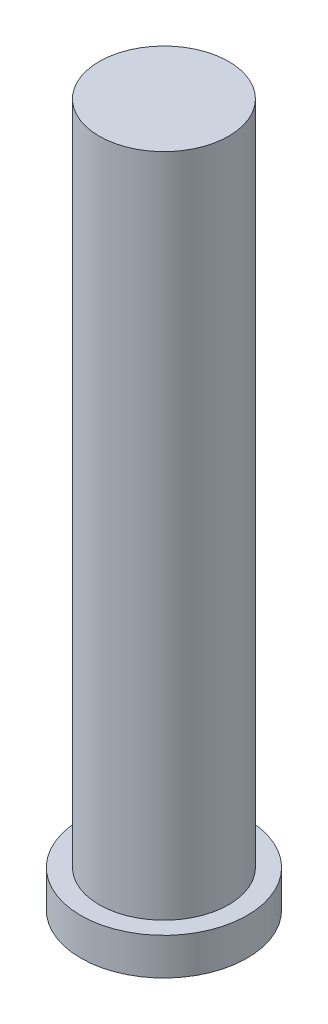
ISO-10303-21;
HEADER;
FILE_DESCRIPTION(('STEP AP214'),'2;1');
FILE_NAME('part.step','',(''),(''),'','','');
FILE_SCHEMA(('AUTOMOTIVE_DESIGN { 1 0 10303 214 1 1 1 1 }'));
ENDSEC;
DATA;
#1=APPLICATION_CONTEXT('core data for automotive mechanical design processes');
#2=APPLICATION_PROTOCOL_DEFINITION('international standard','automotive_design',2000,#1);
#3=PRODUCT_CONTEXT('',#1,'mechanical');
#4=PRODUCT('Part','Part','',(#3));
#5=PRODUCT_RELATED_PRODUCT_CATEGORY('part','',(#4));
#6=PRODUCT_DEFINITION_FORMATION('','',#4);
#7=PRODUCT_DEFINITION_CONTEXT('part definition',#1,'design');
#8=PRODUCT_DEFINITION('design','',#6,#7);
#9=PRODUCT_DEFINITION_SHAPE('','',#8);
#10=(LENGTH_UNIT() NAMED_UNIT(*) SI_UNIT(.MILLI.,.METRE.));
#11=(NAMED_UNIT(*) PLANE_ANGLE_UNIT() SI_UNIT($,.RADIAN.));
#12=(NAMED_UNIT(*) SI_UNIT($,.STERADIAN.) SOLID_ANGLE_UNIT());
#13=UNCERTAINTY_MEASURE_WITH_UNIT(LENGTH_MEASURE(1.E-05),#10,'distance_accuracy_value','');
#14=(GEOMETRIC_REPRESENTATION_CONTEXT(3) GLOBAL_UNCERTAINTY_ASSIGNED_CONTEXT((#13)) GLOBAL_UNIT_ASSIGNED_CONTEXT((#10,
#11,#12)) REPRESENTATION_CONTEXT('',''));
#15=CARTESIAN_POINT('',(0.,0.,0.));
#16=DIRECTION('',(0.,0.,1.));
#17=DIRECTION('',(1.,0.,0.));
#18=AXIS2_PLACEMENT_3D('',#15,#16,#17);
#19=CARTESIAN_POINT('',(0.,1.27,0.));
#20=DIRECTION('',(0.,-1.,0.));
#21=DIRECTION('',(0.,0.,-1.));
#22=AXIS2_PLACEMENT_3D('',#19,#20,#21);
#23=CYLINDRICAL_SURFACE('',#22,2.8575);
#24=CARTESIAN_POINT('',(0.,1.27,0.));
#25=DIRECTION('',(0.,1.,0.));
#26=DIRECTION('',(0.,0.,1.));
#27=AXIS2_PLACEMENT_3D('',#24,#25,#26);
#28=CIRCLE('',#27,2.8575);
#29=CARTESIAN_POINT('',(0.,1.27,2.8575));
#30=VERTEX_POINT('',#29);
#31=EDGE_CURVE('E49',#30,#30,#28,.T.);
#32=ORIENTED_EDGE('',*,*,#31,.F.);
#33=EDGE_LOOP('',(#32));
#34=FACE_BOUND('',#33,.T.);
#35=CARTESIAN_POINT('',(0.,0.,0.));
#36=DIRECTION('',(0.,1.,0.));
#37=DIRECTION('',(0.,0.,1.));
#38=AXIS2_PLACEMENT_3D('',#35,#36,#37);
#39=CIRCLE('',#38,2.8575);
#40=CARTESIAN_POINT('',(0.,0.,2.8575));
#41=VERTEX_POINT('',#40);
#42=EDGE_CURVE('E44',#41,#41,#39,.T.);
#43=ORIENTED_EDGE('',*,*,#42,.T.);
#44=EDGE_LOOP('',(#43));
#45=FACE_BOUND('',#44,.T.);
#46=ADVANCED_FACE('F41',(#34,#45),#23,.T.);
#47=CARTESIAN_POINT('',(0.,1.27,0.));
#48=DIRECTION('',(0.,1.,0.));
#49=DIRECTION('',(0.,0.,1.));
#50=AXIS2_PLACEMENT_3D('',#47,#48,#49);
#51=PLANE('',#50);
#52=CARTESIAN_POINT('',(0.,1.27,0.));
#53=DIRECTION('',(0.,1.,0.));
#54=DIRECTION('',(0.,0.,1.));
#55=AXIS2_PLACEMENT_3D('',#52,#53,#54);
#56=CIRCLE('',#55,2.2225);
#57=CARTESIAN_POINT('',(0.,1.27,2.2225));
#58=VERTEX_POINT('',#57);
#59=EDGE_CURVE('E10',#58,#58,#56,.T.);
#60=ORIENTED_EDGE('',*,*,#59,.F.);
#61=EDGE_LOOP('',(#60));
#62=FACE_BOUND('',#61,.T.);
#63=ORIENTED_EDGE('',*,*,#31,.T.);
#64=EDGE_LOOP('',(#63));
#65=FACE_BOUND('',#64,.T.);
#66=ADVANCED_FACE('F69',(#62,#65),#51,.T.);
#67=CARTESIAN_POINT('',(0.,0.,0.));
#68=DIRECTION('',(0.,1.,0.));
#69=DIRECTION('',(0.,0.,1.));
#70=AXIS2_PLACEMENT_3D('',#67,#68,#69);
#71=PLANE('',#70);
#72=ORIENTED_EDGE('',*,*,#42,.F.);
#73=EDGE_LOOP('',(#72));
#74=FACE_BOUND('',#73,.T.);
#75=ADVANCED_FACE('F66',(#74),#71,.F.);
#76=CARTESIAN_POINT('',(0.,24.13,0.));
#77=DIRECTION('',(0.,-1.,0.));
#78=DIRECTION('',(0.,0.,-1.));
#79=AXIS2_PLACEMENT_3D('',#76,#77,#78);
#80=CYLINDRICAL_SURFACE('',#79,2.2225);
#81=CARTESIAN_POINT('',(0.,24.13,0.));
#82=DIRECTION('',(0.,1.,0.));
#83=DIRECTION('',(0.,0.,1.));
#84=AXIS2_PLACEMENT_3D('',#81,#82,#83);
#85=CIRCLE('',#84,2.2225);
#86=CARTESIAN_POINT('',(0.,24.13,2.2225));
#87=VERTEX_POINT('',#86);
#88=EDGE_CURVE('E56',#87,#87,#85,.T.);
#89=ORIENTED_EDGE('',*,*,#88,.F.);
#90=EDGE_LOOP('',(#89));
#91=FACE_BOUND('',#90,.T.);
#92=ORIENTED_EDGE('',*,*,#59,.T.);
#93=EDGE_LOOP('',(#92));
#94=FACE_BOUND('',#93,.T.);
#95=ADVANCED_FACE('F68',(#91,#94),#80,.T.);
#96=CARTESIAN_POINT('',(0.,24.13,0.));
#97=DIRECTION('',(0.,1.,0.));
#98=DIRECTION('',(0.,0.,1.));
#99=AXIS2_PLACEMENT_3D('',#96,#97,#98);
#100=PLANE('',#99);
#101=ORIENTED_EDGE('',*,*,#88,.T.);
#102=EDGE_LOOP('',(#101));
#103=FACE_BOUND('',#102,.T.);
#104=ADVANCED_FACE('F74',(#103),#100,.T.);
#105=CLOSED_SHELL('',(#46,#66,#75,#95,#104));
#106=MANIFOLD_SOLID_BREP('B2',#105);
#107=ADVANCED_BREP_SHAPE_REPRESENTATION('',(#18,#106),#14);
#108=SHAPE_DEFINITION_REPRESENTATION(#9,#107);
ENDSEC;
END-ISO-10303-21;
